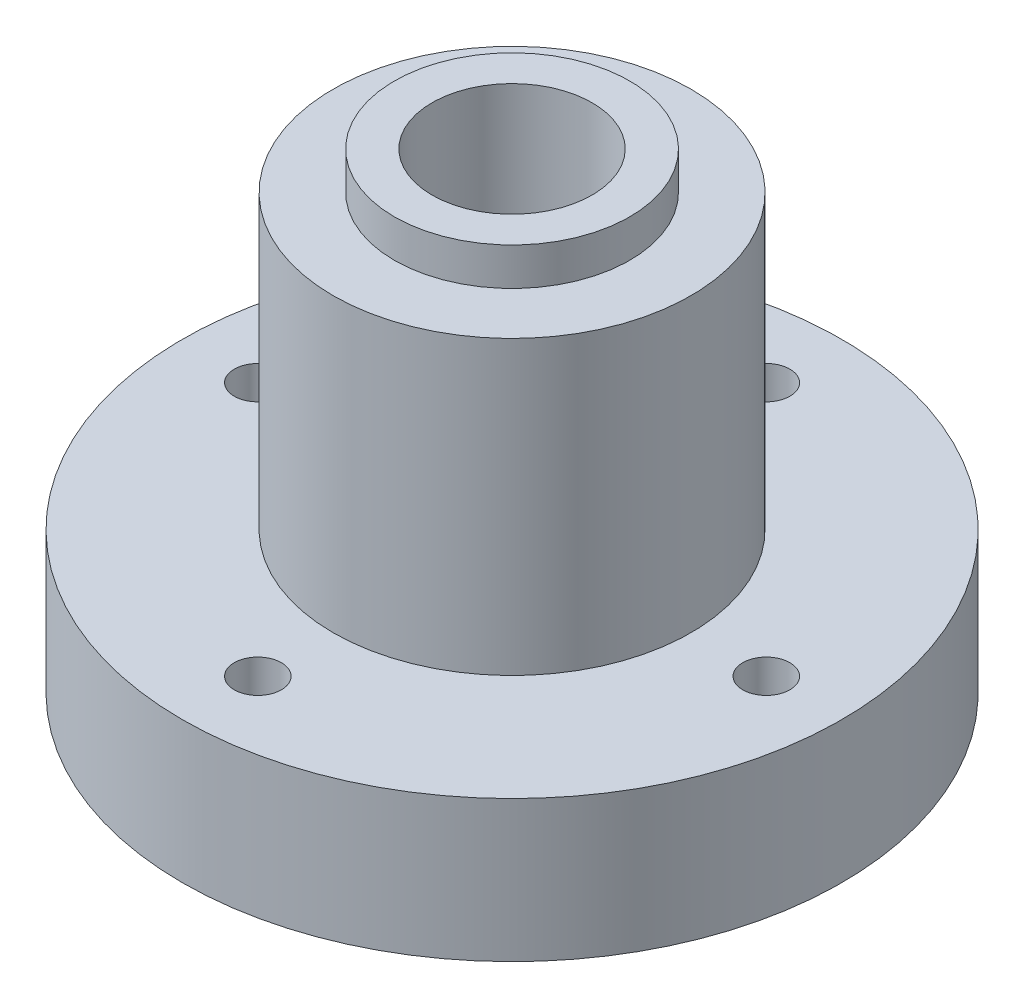
ISO-10303-21;
HEADER;
FILE_DESCRIPTION(('STEP AP214'),'2;1');
FILE_NAME('part.step','',(''),(''),'','','');
FILE_SCHEMA(('AUTOMOTIVE_DESIGN { 1 0 10303 214 1 1 1 1 }'));
ENDSEC;
DATA;
#1=APPLICATION_CONTEXT('core data for automotive mechanical design processes');
#2=APPLICATION_PROTOCOL_DEFINITION('international standard','automotive_design',2000,#1);
#3=PRODUCT_CONTEXT('',#1,'mechanical');
#4=PRODUCT('Part','Part','',(#3));
#5=PRODUCT_RELATED_PRODUCT_CATEGORY('part','',(#4));
#6=PRODUCT_DEFINITION_FORMATION('','',#4);
#7=PRODUCT_DEFINITION_CONTEXT('part definition',#1,'design');
#8=PRODUCT_DEFINITION('design','',#6,#7);
#9=PRODUCT_DEFINITION_SHAPE('','',#8);
#10=(LENGTH_UNIT() NAMED_UNIT(*) SI_UNIT(.MILLI.,.METRE.));
#11=(NAMED_UNIT(*) PLANE_ANGLE_UNIT() SI_UNIT($,.RADIAN.));
#12=(NAMED_UNIT(*) SI_UNIT($,.STERADIAN.) SOLID_ANGLE_UNIT());
#13=UNCERTAINTY_MEASURE_WITH_UNIT(LENGTH_MEASURE(1.E-05),#10,'distance_accuracy_value','');
#14=(GEOMETRIC_REPRESENTATION_CONTEXT(3) GLOBAL_UNCERTAINTY_ASSIGNED_CONTEXT((#13)) GLOBAL_UNIT_ASSIGNED_CONTEXT((#10,
#11,#12)) REPRESENTATION_CONTEXT('',''));
#15=CARTESIAN_POINT('',(0.,0.,0.));
#16=DIRECTION('',(0.,0.,1.));
#17=DIRECTION('',(1.,0.,0.));
#18=AXIS2_PLACEMENT_3D('',#15,#16,#17);
#19=CARTESIAN_POINT('',(0.,0.,0.));
#20=DIRECTION('',(0.,1.,0.));
#21=DIRECTION('',(0.,0.,1.));
#22=AXIS2_PLACEMENT_3D('',#19,#20,#21);
#23=CYLINDRICAL_SURFACE('',#22,8.5);
#24=CARTESIAN_POINT('',(0.,50.,0.));
#25=DIRECTION('',(0.,1.,0.));
#26=DIRECTION('',(0.,0.,1.));
#27=AXIS2_PLACEMENT_3D('',#24,#25,#26);
#28=CIRCLE('',#27,8.50000000000001);
#29=CARTESIAN_POINT('',(0.,50.,8.50000000000001));
#30=VERTEX_POINT('',#29);
#31=EDGE_CURVE('E48',#30,#30,#28,.T.);
#32=ORIENTED_EDGE('',*,*,#31,.T.);
#33=EDGE_LOOP('',(#32));
#34=FACE_BOUND('',#33,.T.);
#35=CARTESIAN_POINT('',(0.,9.,0.));
#36=DIRECTION('',(0.,-1.,0.));
#37=DIRECTION('',(0.,0.,-1.));
#38=AXIS2_PLACEMENT_3D('',#35,#36,#37);
#39=CIRCLE('',#38,8.5);
#40=CARTESIAN_POINT('',(0.,9.,-8.5));
#41=VERTEX_POINT('',#40);
#42=EDGE_CURVE('E35',#41,#41,#39,.T.);
#43=ORIENTED_EDGE('',*,*,#42,.T.);
#44=EDGE_LOOP('',(#43));
#45=FACE_BOUND('',#44,.T.);
#46=ADVANCED_FACE('F31',(#34,#45),#23,.F.);
#47=CARTESIAN_POINT('',(0.,0.,0.));
#48=DIRECTION('',(0.,1.,0.));
#49=DIRECTION('',(0.,0.,1.));
#50=AXIS2_PLACEMENT_3D('',#47,#48,#49);
#51=CYLINDRICAL_SURFACE('',#50,19.);
#52=CARTESIAN_POINT('',(0.,15.,0.));
#53=DIRECTION('',(0.,1.,0.));
#54=DIRECTION('',(0.,0.,1.));
#55=AXIS2_PLACEMENT_3D('',#52,#53,#54);
#56=CIRCLE('',#55,19.);
#57=CARTESIAN_POINT('',(0.,15.,19.));
#58=VERTEX_POINT('',#57);
#59=EDGE_CURVE('E57',#58,#58,#56,.T.);
#60=ORIENTED_EDGE('',*,*,#59,.T.);
#61=EDGE_LOOP('',(#60));
#62=FACE_BOUND('',#61,.T.);
#63=CARTESIAN_POINT('',(0.,46.,0.));
#64=DIRECTION('',(0.,1.,0.));
#65=DIRECTION('',(0.,0.,1.));
#66=AXIS2_PLACEMENT_3D('',#63,#64,#65);
#67=CIRCLE('',#66,19.);
#68=CARTESIAN_POINT('',(0.,46.,19.));
#69=VERTEX_POINT('',#68);
#70=EDGE_CURVE('E10',#69,#69,#67,.T.);
#71=ORIENTED_EDGE('',*,*,#70,.F.);
#72=EDGE_LOOP('',(#71));
#73=FACE_BOUND('',#72,.T.);
#74=ADVANCED_FACE('F33',(#62,#73),#51,.T.);
#75=CARTESIAN_POINT('',(-19.,46.,0.));
#76=DIRECTION('',(0.,1.,0.));
#77=DIRECTION('',(0.,0.,1.));
#78=AXIS2_PLACEMENT_3D('',#75,#76,#77);
#79=PLANE('',#78);
#80=ORIENTED_EDGE('',*,*,#70,.T.);
#81=EDGE_LOOP('',(#80));
#82=FACE_BOUND('',#81,.T.);
#83=CARTESIAN_POINT('',(0.,46.,0.));
#84=DIRECTION('',(0.,1.,0.));
#85=DIRECTION('',(0.,0.,1.));
#86=AXIS2_PLACEMENT_3D('',#83,#84,#85);
#87=CIRCLE('',#86,12.5);
#88=CARTESIAN_POINT('',(0.,46.,12.5));
#89=VERTEX_POINT('',#88);
#90=EDGE_CURVE('E39',#89,#89,#87,.T.);
#91=ORIENTED_EDGE('',*,*,#90,.F.);
#92=EDGE_LOOP('',(#91));
#93=FACE_BOUND('',#92,.T.);
#94=ADVANCED_FACE('F111',(#82,#93),#79,.T.);
#95=CARTESIAN_POINT('',(0.,0.,0.));
#96=DIRECTION('',(0.,1.,0.));
#97=DIRECTION('',(0.,0.,1.));
#98=AXIS2_PLACEMENT_3D('',#95,#96,#97);
#99=CYLINDRICAL_SURFACE('',#98,12.5);
#100=ORIENTED_EDGE('',*,*,#90,.T.);
#101=EDGE_LOOP('',(#100));
#102=FACE_BOUND('',#101,.T.);
#103=CARTESIAN_POINT('',(0.,50.,0.));
#104=DIRECTION('',(0.,1.,0.));
#105=DIRECTION('',(0.,0.,1.));
#106=AXIS2_PLACEMENT_3D('',#103,#104,#105);
#107=CIRCLE('',#106,12.5);
#108=CARTESIAN_POINT('',(0.,50.,12.5));
#109=VERTEX_POINT('',#108);
#110=EDGE_CURVE('E43',#109,#109,#107,.T.);
#111=ORIENTED_EDGE('',*,*,#110,.F.);
#112=EDGE_LOOP('',(#111));
#113=FACE_BOUND('',#112,.T.);
#114=ADVANCED_FACE('F120',(#102,#113),#99,.T.);
#115=CARTESIAN_POINT('',(-12.5,50.,0.));
#116=DIRECTION('',(0.,1.,0.));
#117=DIRECTION('',(0.,0.,1.));
#118=AXIS2_PLACEMENT_3D('',#115,#116,#117);
#119=PLANE('',#118);
#120=ORIENTED_EDGE('',*,*,#110,.T.);
#121=EDGE_LOOP('',(#120));
#122=FACE_BOUND('',#121,.T.);
#123=ORIENTED_EDGE('',*,*,#31,.F.);
#124=EDGE_LOOP('',(#123));
#125=FACE_BOUND('',#124,.T.);
#126=ADVANCED_FACE('F117',(#122,#125),#119,.T.);
#127=CARTESIAN_POINT('',(-8.5,0.,0.));
#128=DIRECTION('',(0.,-1.,0.));
#129=DIRECTION('',(0.,0.,-1.));
#130=AXIS2_PLACEMENT_3D('',#127,#128,#129);
#131=PLANE('',#130);
#132=CARTESIAN_POINT('',(0.,0.,0.));
#133=DIRECTION('',(0.,-1.,0.));
#134=DIRECTION('',(0.,0.,-1.));
#135=AXIS2_PLACEMENT_3D('',#132,#133,#134);
#136=CIRCLE('',#135,16.);
#137=CARTESIAN_POINT('',(0.,0.,-16.));
#138=VERTEX_POINT('',#137);
#139=EDGE_CURVE('E84',#138,#138,#136,.T.);
#140=ORIENTED_EDGE('',*,*,#139,.F.);
#141=EDGE_LOOP('',(#140));
#142=FACE_BOUND('',#141,.T.);
#143=CARTESIAN_POINT('',(-27.,0.,0.));
#144=DIRECTION('',(0.,1.,0.));
#145=DIRECTION('',(0.,0.,1.));
#146=AXIS2_PLACEMENT_3D('',#143,#144,#145);
#147=CIRCLE('',#146,2.5);
#148=CARTESIAN_POINT('',(-27.,0.,2.5));
#149=VERTEX_POINT('',#148);
#150=EDGE_CURVE('E78',#149,#149,#147,.T.);
#151=ORIENTED_EDGE('',*,*,#150,.T.);
#152=EDGE_LOOP('',(#151));
#153=FACE_BOUND('',#152,.T.);
#154=CARTESIAN_POINT('',(0.,0.,-27.));
#155=DIRECTION('',(0.,1.,0.));
#156=DIRECTION('',(0.,0.,1.));
#157=AXIS2_PLACEMENT_3D('',#154,#155,#156);
#158=CIRCLE('',#157,2.5);
#159=CARTESIAN_POINT('',(0.,0.,-24.5));
#160=VERTEX_POINT('',#159);
#161=EDGE_CURVE('E72',#160,#160,#158,.T.);
#162=ORIENTED_EDGE('',*,*,#161,.T.);
#163=EDGE_LOOP('',(#162));
#164=FACE_BOUND('',#163,.T.);
#165=CARTESIAN_POINT('',(27.,0.,0.));
#166=DIRECTION('',(0.,1.,0.));
#167=DIRECTION('',(0.,0.,1.));
#168=AXIS2_PLACEMENT_3D('',#165,#166,#167);
#169=CIRCLE('',#168,2.5);
#170=CARTESIAN_POINT('',(27.,0.,2.5));
#171=VERTEX_POINT('',#170);
#172=EDGE_CURVE('E66',#171,#171,#169,.T.);
#173=ORIENTED_EDGE('',*,*,#172,.T.);
#174=EDGE_LOOP('',(#173));
#175=FACE_BOUND('',#174,.T.);
#176=CARTESIAN_POINT('',(0.,0.,27.));
#177=DIRECTION('',(0.,1.,0.));
#178=DIRECTION('',(0.,0.,1.));
#179=AXIS2_PLACEMENT_3D('',#176,#177,#178);
#180=CIRCLE('',#179,2.5);
#181=CARTESIAN_POINT('',(0.,0.,29.5));
#182=VERTEX_POINT('',#181);
#183=EDGE_CURVE('E60',#182,#182,#180,.T.);
#184=ORIENTED_EDGE('',*,*,#183,.T.);
#185=EDGE_LOOP('',(#184));
#186=FACE_BOUND('',#185,.T.);
#187=CARTESIAN_POINT('',(0.,0.,0.));
#188=DIRECTION('',(0.,1.,0.));
#189=DIRECTION('',(0.,0.,1.));
#190=AXIS2_PLACEMENT_3D('',#187,#188,#189);
#191=CIRCLE('',#190,35.);
#192=CARTESIAN_POINT('',(0.,0.,35.));
#193=VERTEX_POINT('',#192);
#194=EDGE_CURVE('E51',#193,#193,#191,.T.);
#195=ORIENTED_EDGE('',*,*,#194,.F.);
#196=EDGE_LOOP('',(#195));
#197=FACE_BOUND('',#196,.T.);
#198=ADVANCED_FACE('F115',(#142,#153,#164,#175,#186,#197),#131,.T.);
#199=CARTESIAN_POINT('',(0.,0.,0.));
#200=DIRECTION('',(0.,1.,0.));
#201=DIRECTION('',(0.,0.,1.));
#202=AXIS2_PLACEMENT_3D('',#199,#200,#201);
#203=CYLINDRICAL_SURFACE('',#202,35.);
#204=ORIENTED_EDGE('',*,*,#194,.T.);
#205=EDGE_LOOP('',(#204));
#206=FACE_BOUND('',#205,.T.);
#207=CARTESIAN_POINT('',(0.,15.,0.));
#208=DIRECTION('',(0.,1.,0.));
#209=DIRECTION('',(0.,0.,1.));
#210=AXIS2_PLACEMENT_3D('',#207,#208,#209);
#211=CIRCLE('',#210,35.);
#212=CARTESIAN_POINT('',(0.,15.,35.));
#213=VERTEX_POINT('',#212);
#214=EDGE_CURVE('E54',#213,#213,#211,.T.);
#215=ORIENTED_EDGE('',*,*,#214,.F.);
#216=EDGE_LOOP('',(#215));
#217=FACE_BOUND('',#216,.T.);
#218=ADVANCED_FACE('F150',(#206,#217),#203,.T.);
#219=CARTESIAN_POINT('',(-35.,15.,0.));
#220=DIRECTION('',(0.,1.,0.));
#221=DIRECTION('',(0.,0.,1.));
#222=AXIS2_PLACEMENT_3D('',#219,#220,#221);
#223=PLANE('',#222);
#224=CARTESIAN_POINT('',(-27.,15.,0.));
#225=DIRECTION('',(0.,1.,0.));
#226=DIRECTION('',(0.,0.,1.));
#227=AXIS2_PLACEMENT_3D('',#224,#225,#226);
#228=CIRCLE('',#227,2.5);
#229=CARTESIAN_POINT('',(-27.,15.,2.5));
#230=VERTEX_POINT('',#229);
#231=EDGE_CURVE('E81',#230,#230,#228,.T.);
#232=ORIENTED_EDGE('',*,*,#231,.F.);
#233=EDGE_LOOP('',(#232));
#234=FACE_BOUND('',#233,.T.);
#235=CARTESIAN_POINT('',(0.,15.,-27.));
#236=DIRECTION('',(0.,1.,0.));
#237=DIRECTION('',(0.,0.,1.));
#238=AXIS2_PLACEMENT_3D('',#235,#236,#237);
#239=CIRCLE('',#238,2.5);
#240=CARTESIAN_POINT('',(0.,15.,-24.5));
#241=VERTEX_POINT('',#240);
#242=EDGE_CURVE('E75',#241,#241,#239,.T.);
#243=ORIENTED_EDGE('',*,*,#242,.F.);
#244=EDGE_LOOP('',(#243));
#245=FACE_BOUND('',#244,.T.);
#246=CARTESIAN_POINT('',(27.,15.,0.));
#247=DIRECTION('',(0.,1.,0.));
#248=DIRECTION('',(0.,0.,1.));
#249=AXIS2_PLACEMENT_3D('',#246,#247,#248);
#250=CIRCLE('',#249,2.5);
#251=CARTESIAN_POINT('',(27.,15.,2.5));
#252=VERTEX_POINT('',#251);
#253=EDGE_CURVE('E69',#252,#252,#250,.T.);
#254=ORIENTED_EDGE('',*,*,#253,.F.);
#255=EDGE_LOOP('',(#254));
#256=FACE_BOUND('',#255,.T.);
#257=CARTESIAN_POINT('',(0.,15.,27.));
#258=DIRECTION('',(0.,1.,0.));
#259=DIRECTION('',(0.,0.,1.));
#260=AXIS2_PLACEMENT_3D('',#257,#258,#259);
#261=CIRCLE('',#260,2.5);
#262=CARTESIAN_POINT('',(0.,15.,29.5));
#263=VERTEX_POINT('',#262);
#264=EDGE_CURVE('E63',#263,#263,#261,.T.);
#265=ORIENTED_EDGE('',*,*,#264,.F.);
#266=EDGE_LOOP('',(#265));
#267=FACE_BOUND('',#266,.T.);
#268=ORIENTED_EDGE('',*,*,#214,.T.);
#269=EDGE_LOOP('',(#268));
#270=FACE_BOUND('',#269,.T.);
#271=ORIENTED_EDGE('',*,*,#59,.F.);
#272=EDGE_LOOP('',(#271));
#273=FACE_BOUND('',#272,.T.);
#274=ADVANCED_FACE('F157',(#234,#245,#256,#267,#270,#273),#223,.T.);
#275=CARTESIAN_POINT('',(0.,15.,27.));
#276=DIRECTION('',(0.,1.,0.));
#277=DIRECTION('',(0.,0.,1.));
#278=AXIS2_PLACEMENT_3D('',#275,#276,#277);
#279=CYLINDRICAL_SURFACE('',#278,2.5);
#280=ORIENTED_EDGE('',*,*,#183,.F.);
#281=EDGE_LOOP('',(#280));
#282=FACE_BOUND('',#281,.T.);
#283=ORIENTED_EDGE('',*,*,#264,.T.);
#284=EDGE_LOOP('',(#283));
#285=FACE_BOUND('',#284,.T.);
#286=ADVANCED_FACE('F164',(#282,#285),#279,.F.);
#287=CARTESIAN_POINT('',(27.,15.,0.));
#288=DIRECTION('',(0.,1.,0.));
#289=DIRECTION('',(0.,0.,1.));
#290=AXIS2_PLACEMENT_3D('',#287,#288,#289);
#291=CYLINDRICAL_SURFACE('',#290,2.5);
#292=ORIENTED_EDGE('',*,*,#172,.F.);
#293=EDGE_LOOP('',(#292));
#294=FACE_BOUND('',#293,.T.);
#295=ORIENTED_EDGE('',*,*,#253,.T.);
#296=EDGE_LOOP('',(#295));
#297=FACE_BOUND('',#296,.T.);
#298=ADVANCED_FACE('F172',(#294,#297),#291,.F.);
#299=CARTESIAN_POINT('',(0.,15.,-27.));
#300=DIRECTION('',(0.,1.,0.));
#301=DIRECTION('',(0.,0.,1.));
#302=AXIS2_PLACEMENT_3D('',#299,#300,#301);
#303=CYLINDRICAL_SURFACE('',#302,2.5);
#304=ORIENTED_EDGE('',*,*,#161,.F.);
#305=EDGE_LOOP('',(#304));
#306=FACE_BOUND('',#305,.T.);
#307=ORIENTED_EDGE('',*,*,#242,.T.);
#308=EDGE_LOOP('',(#307));
#309=FACE_BOUND('',#308,.T.);
#310=ADVANCED_FACE('F180',(#306,#309),#303,.F.);
#311=CARTESIAN_POINT('',(-27.,15.,0.));
#312=DIRECTION('',(0.,1.,0.));
#313=DIRECTION('',(0.,0.,1.));
#314=AXIS2_PLACEMENT_3D('',#311,#312,#313);
#315=CYLINDRICAL_SURFACE('',#314,2.5);
#316=ORIENTED_EDGE('',*,*,#150,.F.);
#317=EDGE_LOOP('',(#316));
#318=FACE_BOUND('',#317,.T.);
#319=ORIENTED_EDGE('',*,*,#231,.T.);
#320=EDGE_LOOP('',(#319));
#321=FACE_BOUND('',#320,.T.);
#322=ADVANCED_FACE('F102',(#318,#321),#315,.F.);
#323=CARTESIAN_POINT('',(0.,9.,0.));
#324=DIRECTION('',(0.,-1.,0.));
#325=DIRECTION('',(0.,0.,-1.));
#326=AXIS2_PLACEMENT_3D('',#323,#324,#325);
#327=CYLINDRICAL_SURFACE('',#326,16.);
#328=CARTESIAN_POINT('',(0.,9.,0.));
#329=DIRECTION('',(0.,-1.,0.));
#330=DIRECTION('',(0.,0.,-1.));
#331=AXIS2_PLACEMENT_3D('',#328,#329,#330);
#332=CIRCLE('',#331,16.);
#333=CARTESIAN_POINT('',(0.,9.,-16.));
#334=VERTEX_POINT('',#333);
#335=EDGE_CURVE('E87',#334,#334,#332,.T.);
#336=ORIENTED_EDGE('',*,*,#335,.F.);
#337=EDGE_LOOP('',(#336));
#338=FACE_BOUND('',#337,.T.);
#339=ORIENTED_EDGE('',*,*,#139,.T.);
#340=EDGE_LOOP('',(#339));
#341=FACE_BOUND('',#340,.T.);
#342=ADVANCED_FACE('F97',(#338,#341),#327,.F.);
#343=CARTESIAN_POINT('',(0.,9.,0.));
#344=DIRECTION('',(0.,-1.,0.));
#345=DIRECTION('',(0.,0.,-1.));
#346=AXIS2_PLACEMENT_3D('',#343,#344,#345);
#347=PLANE('',#346);
#348=ORIENTED_EDGE('',*,*,#42,.F.);
#349=EDGE_LOOP('',(#348));
#350=FACE_BOUND('',#349,.T.);
#351=ORIENTED_EDGE('',*,*,#335,.T.);
#352=EDGE_LOOP('',(#351));
#353=FACE_BOUND('',#352,.T.);
#354=ADVANCED_FACE('F95',(#350,#353),#347,.T.);
#355=CLOSED_SHELL('',(#46,#74,#94,#114,#126,#198,#218,#274,#286,#298,#310,#322,#342,#354));
#356=MANIFOLD_SOLID_BREP('B2',#355);
#357=ADVANCED_BREP_SHAPE_REPRESENTATION('',(#18,#356),#14);
#358=SHAPE_DEFINITION_REPRESENTATION(#9,#357);
ENDSEC;
END-ISO-10303-21;
